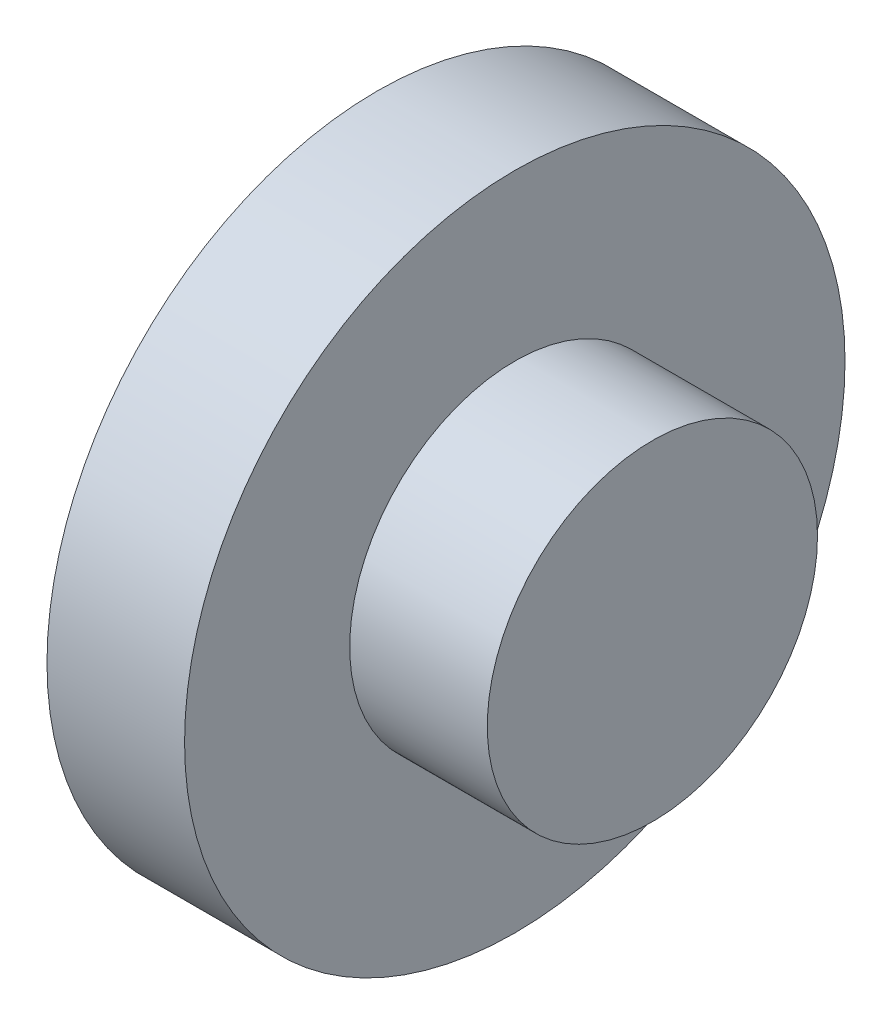
ISO-10303-21;
HEADER;
FILE_DESCRIPTION(('STEP AP214'),'2;1');
FILE_NAME('part.step','',(''),(''),'','','');
FILE_SCHEMA(('AUTOMOTIVE_DESIGN { 1 0 10303 214 1 1 1 1 }'));
ENDSEC;
DATA;
#1=APPLICATION_CONTEXT('core data for automotive mechanical design processes');
#2=APPLICATION_PROTOCOL_DEFINITION('international standard','automotive_design',2000,#1);
#3=PRODUCT_CONTEXT('',#1,'mechanical');
#4=PRODUCT('Part','Part','',(#3));
#5=PRODUCT_RELATED_PRODUCT_CATEGORY('part','',(#4));
#6=PRODUCT_DEFINITION_FORMATION('','',#4);
#7=PRODUCT_DEFINITION_CONTEXT('part definition',#1,'design');
#8=PRODUCT_DEFINITION('design','',#6,#7);
#9=PRODUCT_DEFINITION_SHAPE('','',#8);
#10=(LENGTH_UNIT() NAMED_UNIT(*) SI_UNIT(.MILLI.,.METRE.));
#11=(NAMED_UNIT(*) PLANE_ANGLE_UNIT() SI_UNIT($,.RADIAN.));
#12=(NAMED_UNIT(*) SI_UNIT($,.STERADIAN.) SOLID_ANGLE_UNIT());
#13=UNCERTAINTY_MEASURE_WITH_UNIT(LENGTH_MEASURE(1.E-05),#10,'distance_accuracy_value','');
#14=(GEOMETRIC_REPRESENTATION_CONTEXT(3) GLOBAL_UNCERTAINTY_ASSIGNED_CONTEXT((#13)) GLOBAL_UNIT_ASSIGNED_CONTEXT((#10,
#11,#12)) REPRESENTATION_CONTEXT('',''));
#15=CARTESIAN_POINT('',(0.,0.,0.));
#16=DIRECTION('',(0.,0.,1.));
#17=DIRECTION('',(1.,0.,0.));
#18=AXIS2_PLACEMENT_3D('',#15,#16,#17);
#19=CARTESIAN_POINT('',(10.,0.,0.));
#20=DIRECTION('',(-1.,0.,0.));
#21=DIRECTION('',(0.,0.,1.));
#22=AXIS2_PLACEMENT_3D('',#19,#20,#21);
#23=CYLINDRICAL_SURFACE('',#22,24.);
#24=CARTESIAN_POINT('',(10.,0.,0.));
#25=DIRECTION('',(1.,0.,0.));
#26=DIRECTION('',(0.,0.,-1.));
#27=AXIS2_PLACEMENT_3D('',#24,#25,#26);
#28=CIRCLE('',#27,24.);
#29=CARTESIAN_POINT('',(10.,0.,-24.));
#30=VERTEX_POINT('',#29);
#31=EDGE_CURVE('E39',#30,#30,#28,.T.);
#32=ORIENTED_EDGE('',*,*,#31,.F.);
#33=EDGE_LOOP('',(#32));
#34=FACE_BOUND('',#33,.T.);
#35=CARTESIAN_POINT('',(0.,0.,0.));
#36=DIRECTION('',(1.,0.,0.));
#37=DIRECTION('',(0.,0.,-1.));
#38=AXIS2_PLACEMENT_3D('',#35,#36,#37);
#39=CIRCLE('',#38,24.);
#40=CARTESIAN_POINT('',(0.,0.,-24.));
#41=VERTEX_POINT('',#40);
#42=EDGE_CURVE('E35',#41,#41,#39,.T.);
#43=ORIENTED_EDGE('',*,*,#42,.T.);
#44=EDGE_LOOP('',(#43));
#45=FACE_BOUND('',#44,.T.);
#46=ADVANCED_FACE('F32',(#34,#45),#23,.T.);
#47=CARTESIAN_POINT('',(10.,0.,0.));
#48=DIRECTION('',(1.,0.,0.));
#49=DIRECTION('',(0.,0.,-1.));
#50=AXIS2_PLACEMENT_3D('',#47,#48,#49);
#51=PLANE('',#50);
#52=CARTESIAN_POINT('',(10.,0.,0.));
#53=DIRECTION('',(1.,0.,0.));
#54=DIRECTION('',(0.,0.,-1.));
#55=AXIS2_PLACEMENT_3D('',#52,#53,#54);
#56=CIRCLE('',#55,12.);
#57=CARTESIAN_POINT('',(10.,0.,-12.));
#58=VERTEX_POINT('',#57);
#59=EDGE_CURVE('E10',#58,#58,#56,.T.);
#60=ORIENTED_EDGE('',*,*,#59,.F.);
#61=EDGE_LOOP('',(#60));
#62=FACE_BOUND('',#61,.T.);
#63=ORIENTED_EDGE('',*,*,#31,.T.);
#64=EDGE_LOOP('',(#63));
#65=FACE_BOUND('',#64,.T.);
#66=ADVANCED_FACE('F56',(#62,#65),#51,.T.);
#67=CARTESIAN_POINT('',(0.,0.,0.));
#68=DIRECTION('',(1.,0.,0.));
#69=DIRECTION('',(0.,0.,-1.));
#70=AXIS2_PLACEMENT_3D('',#67,#68,#69);
#71=PLANE('',#70);
#72=ORIENTED_EDGE('',*,*,#42,.F.);
#73=EDGE_LOOP('',(#72));
#74=FACE_BOUND('',#73,.T.);
#75=ADVANCED_FACE('F53',(#74),#71,.F.);
#76=CARTESIAN_POINT('',(20.,0.,0.));
#77=DIRECTION('',(-1.,0.,0.));
#78=DIRECTION('',(0.,0.,1.));
#79=AXIS2_PLACEMENT_3D('',#76,#77,#78);
#80=CYLINDRICAL_SURFACE('',#79,12.);
#81=CARTESIAN_POINT('',(20.,0.,0.));
#82=DIRECTION('',(1.,0.,0.));
#83=DIRECTION('',(0.,0.,-1.));
#84=AXIS2_PLACEMENT_3D('',#81,#82,#83);
#85=CIRCLE('',#84,12.);
#86=CARTESIAN_POINT('',(20.,0.,-12.));
#87=VERTEX_POINT('',#86);
#88=EDGE_CURVE('E45',#87,#87,#85,.T.);
#89=ORIENTED_EDGE('',*,*,#88,.F.);
#90=EDGE_LOOP('',(#89));
#91=FACE_BOUND('',#90,.T.);
#92=ORIENTED_EDGE('',*,*,#59,.T.);
#93=EDGE_LOOP('',(#92));
#94=FACE_BOUND('',#93,.T.);
#95=ADVANCED_FACE('F55',(#91,#94),#80,.T.);
#96=CARTESIAN_POINT('',(20.,0.,0.));
#97=DIRECTION('',(1.,0.,0.));
#98=DIRECTION('',(0.,0.,-1.));
#99=AXIS2_PLACEMENT_3D('',#96,#97,#98);
#100=PLANE('',#99);
#101=ORIENTED_EDGE('',*,*,#88,.T.);
#102=EDGE_LOOP('',(#101));
#103=FACE_BOUND('',#102,.T.);
#104=ADVANCED_FACE('F61',(#103),#100,.T.);
#105=CLOSED_SHELL('',(#46,#66,#75,#95,#104));
#106=MANIFOLD_SOLID_BREP('B2',#105);
#107=ADVANCED_BREP_SHAPE_REPRESENTATION('',(#18,#106),#14);
#108=SHAPE_DEFINITION_REPRESENTATION(#9,#107);
ENDSEC;
END-ISO-10303-21;
